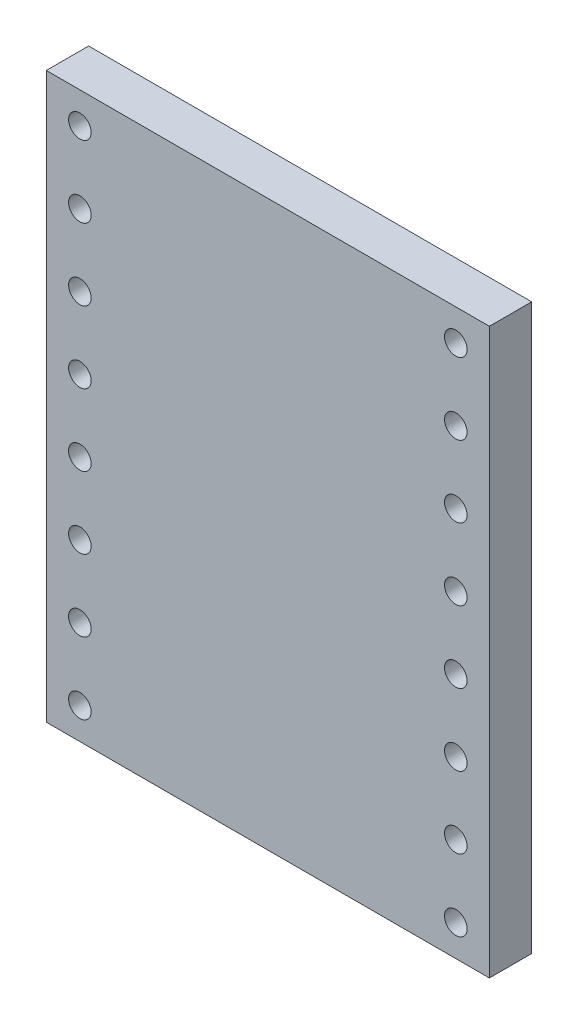
ISO-10303-21;
HEADER;
FILE_DESCRIPTION(('STEP AP214'),'2;1');
FILE_NAME('part.step','',(''),(''),'','','');
FILE_SCHEMA(('AUTOMOTIVE_DESIGN { 1 0 10303 214 1 1 1 1 }'));
ENDSEC;
DATA;
#1=APPLICATION_CONTEXT('core data for automotive mechanical design processes');
#2=APPLICATION_PROTOCOL_DEFINITION('international standard','automotive_design',2000,#1);
#3=PRODUCT_CONTEXT('',#1,'mechanical');
#4=PRODUCT('Part','Part','',(#3));
#5=PRODUCT_RELATED_PRODUCT_CATEGORY('part','',(#4));
#6=PRODUCT_DEFINITION_FORMATION('','',#4);
#7=PRODUCT_DEFINITION_CONTEXT('part definition',#1,'design');
#8=PRODUCT_DEFINITION('design','',#6,#7);
#9=PRODUCT_DEFINITION_SHAPE('','',#8);
#10=(LENGTH_UNIT() NAMED_UNIT(*) SI_UNIT(.MILLI.,.METRE.));
#11=(NAMED_UNIT(*) PLANE_ANGLE_UNIT() SI_UNIT($,.RADIAN.));
#12=(NAMED_UNIT(*) SI_UNIT($,.STERADIAN.) SOLID_ANGLE_UNIT());
#13=UNCERTAINTY_MEASURE_WITH_UNIT(LENGTH_MEASURE(1.E-05),#10,'distance_accuracy_value','');
#14=(GEOMETRIC_REPRESENTATION_CONTEXT(3) GLOBAL_UNCERTAINTY_ASSIGNED_CONTEXT((#13)) GLOBAL_UNIT_ASSIGNED_CONTEXT((#10,
#11,#12)) REPRESENTATION_CONTEXT('',''));
#15=CARTESIAN_POINT('',(0.,0.,0.));
#16=DIRECTION('',(0.,0.,1.));
#17=DIRECTION('',(1.,0.,0.));
#18=AXIS2_PLACEMENT_3D('',#15,#16,#17);
#19=CARTESIAN_POINT('',(7.85,-10.,1.5));
#20=DIRECTION('',(-1.,0.,0.));
#21=DIRECTION('',(0.,0.,1.));
#22=AXIS2_PLACEMENT_3D('',#19,#20,#21);
#23=PLANE('',#22);
#24=DIRECTION('',(0.,1.,0.));
#25=VECTOR('',#24,1.);
#26=CARTESIAN_POINT('',(7.85,-10.,0.));
#27=LINE('',#26,#25);
#28=CARTESIAN_POINT('',(7.85,-10.,0.));
#29=VERTEX_POINT('',#28);
#30=CARTESIAN_POINT('',(7.85,10.,0.));
#31=VERTEX_POINT('',#30);
#32=EDGE_CURVE('E95',#29,#31,#27,.T.);
#33=ORIENTED_EDGE('',*,*,#32,.T.);
#34=DIRECTION('',(0.,0.,-1.));
#35=VECTOR('',#34,1.);
#36=CARTESIAN_POINT('',(7.85,10.,1.5));
#37=LINE('',#36,#35);
#38=CARTESIAN_POINT('',(7.85,10.,1.5));
#39=VERTEX_POINT('',#38);
#40=EDGE_CURVE('E11',#39,#31,#37,.T.);
#41=ORIENTED_EDGE('',*,*,#40,.F.);
#42=DIRECTION('',(0.,1.,0.));
#43=VECTOR('',#42,1.);
#44=CARTESIAN_POINT('',(7.85,-10.,1.5));
#45=LINE('',#44,#43);
#46=CARTESIAN_POINT('',(7.85,-10.,1.5));
#47=VERTEX_POINT('',#46);
#48=EDGE_CURVE('E83',#47,#39,#45,.T.);
#49=ORIENTED_EDGE('',*,*,#48,.F.);
#50=DIRECTION('',(0.,0.,-1.));
#51=VECTOR('',#50,1.);
#52=CARTESIAN_POINT('',(7.85,-10.,1.5));
#53=LINE('',#52,#51);
#54=EDGE_CURVE('E91',#47,#29,#53,.T.);
#55=ORIENTED_EDGE('',*,*,#54,.T.);
#56=EDGE_LOOP('',(#33,#41,#49,#55));
#57=FACE_BOUND('',#56,.T.);
#58=ADVANCED_FACE('F32',(#57),#23,.F.);
#59=CARTESIAN_POINT('',(-7.85,10.,1.5));
#60=DIRECTION('',(0.,-1.,0.));
#61=DIRECTION('',(0.,0.,-1.));
#62=AXIS2_PLACEMENT_3D('',#59,#60,#61);
#63=PLANE('',#62);
#64=DIRECTION('',(-1.,0.,0.));
#65=VECTOR('',#64,1.);
#66=CARTESIAN_POINT('',(-7.85,10.,0.));
#67=LINE('',#66,#65);
#68=CARTESIAN_POINT('',(-7.85,10.,0.));
#69=VERTEX_POINT('',#68);
#70=EDGE_CURVE('E87',#31,#69,#67,.T.);
#71=ORIENTED_EDGE('',*,*,#70,.T.);
#72=DIRECTION('',(0.,0.,-1.));
#73=VECTOR('',#72,1.);
#74=CARTESIAN_POINT('',(-7.85,10.,1.5));
#75=LINE('',#74,#73);
#76=CARTESIAN_POINT('',(-7.85,10.,1.5));
#77=VERTEX_POINT('',#76);
#78=EDGE_CURVE('E40',#77,#69,#75,.T.);
#79=ORIENTED_EDGE('',*,*,#78,.F.);
#80=DIRECTION('',(-1.,0.,0.));
#81=VECTOR('',#80,1.);
#82=CARTESIAN_POINT('',(-7.85,10.,1.5));
#83=LINE('',#82,#81);
#84=EDGE_CURVE('E78',#39,#77,#83,.T.);
#85=ORIENTED_EDGE('',*,*,#84,.F.);
#86=ORIENTED_EDGE('',*,*,#40,.T.);
#87=EDGE_LOOP('',(#71,#79,#85,#86));
#88=FACE_BOUND('',#87,.T.);
#89=ADVANCED_FACE('F86',(#88),#63,.F.);
#90=CARTESIAN_POINT('',(-7.85,-10.,1.5));
#91=DIRECTION('',(1.,0.,0.));
#92=DIRECTION('',(0.,0.,-1.));
#93=AXIS2_PLACEMENT_3D('',#90,#91,#92);
#94=PLANE('',#93);
#95=DIRECTION('',(0.,-1.,0.));
#96=VECTOR('',#95,1.);
#97=CARTESIAN_POINT('',(-7.85,-10.,0.));
#98=LINE('',#97,#96);
#99=CARTESIAN_POINT('',(-7.85,-10.,0.));
#100=VERTEX_POINT('',#99);
#101=EDGE_CURVE('E65',#69,#100,#98,.T.);
#102=ORIENTED_EDGE('',*,*,#101,.T.);
#103=DIRECTION('',(0.,0.,-1.));
#104=VECTOR('',#103,1.);
#105=CARTESIAN_POINT('',(-7.85,-10.,1.5));
#106=LINE('',#105,#104);
#107=CARTESIAN_POINT('',(-7.85,-10.,1.5));
#108=VERTEX_POINT('',#107);
#109=EDGE_CURVE('E88',#108,#100,#106,.T.);
#110=ORIENTED_EDGE('',*,*,#109,.F.);
#111=DIRECTION('',(0.,-1.,0.));
#112=VECTOR('',#111,1.);
#113=CARTESIAN_POINT('',(-7.85,-10.,1.5));
#114=LINE('',#113,#112);
#115=EDGE_CURVE('E81',#77,#108,#114,.T.);
#116=ORIENTED_EDGE('',*,*,#115,.F.);
#117=ORIENTED_EDGE('',*,*,#78,.T.);
#118=EDGE_LOOP('',(#102,#110,#116,#117));
#119=FACE_BOUND('',#118,.T.);
#120=ADVANCED_FACE('F89',(#119),#94,.F.);
#121=CARTESIAN_POINT('',(-7.85,-10.,1.5));
#122=DIRECTION('',(0.,1.,0.));
#123=DIRECTION('',(0.,0.,1.));
#124=AXIS2_PLACEMENT_3D('',#121,#122,#123);
#125=PLANE('',#124);
#126=DIRECTION('',(1.,0.,0.));
#127=VECTOR('',#126,1.);
#128=CARTESIAN_POINT('',(-7.85,-10.,0.));
#129=LINE('',#128,#127);
#130=EDGE_CURVE('E71',#100,#29,#129,.T.);
#131=ORIENTED_EDGE('',*,*,#130,.T.);
#132=ORIENTED_EDGE('',*,*,#54,.F.);
#133=DIRECTION('',(1.,0.,0.));
#134=VECTOR('',#133,1.);
#135=CARTESIAN_POINT('',(-7.85,-10.,1.5));
#136=LINE('',#135,#134);
#137=EDGE_CURVE('E48',#108,#47,#136,.T.);
#138=ORIENTED_EDGE('',*,*,#137,.F.);
#139=ORIENTED_EDGE('',*,*,#109,.T.);
#140=EDGE_LOOP('',(#131,#132,#138,#139));
#141=FACE_BOUND('',#140,.T.);
#142=ADVANCED_FACE('F103',(#141),#125,.F.);
#143=CARTESIAN_POINT('',(0.,0.,1.5));
#144=DIRECTION('',(0.,0.,-1.));
#145=DIRECTION('',(-1.,0.,0.));
#146=AXIS2_PLACEMENT_3D('',#143,#144,#145);
#147=PLANE('',#146);
#148=CARTESIAN_POINT('',(6.66,8.89,1.5));
#149=DIRECTION('',(0.,0.,1.));
#150=DIRECTION('',(-1.,0.,0.));
#151=AXIS2_PLACEMENT_3D('',#148,#149,#150);
#152=CIRCLE('',#151,0.4);
#153=CARTESIAN_POINT('',(6.26,8.89,1.5));
#154=VERTEX_POINT('',#153);
#155=EDGE_CURVE('E199',#154,#154,#152,.T.);
#156=ORIENTED_EDGE('',*,*,#155,.F.);
#157=EDGE_LOOP('',(#156));
#158=FACE_BOUND('',#157,.T.);
#159=CARTESIAN_POINT('',(6.66,6.35,1.5));
#160=DIRECTION('',(0.,0.,1.));
#161=DIRECTION('',(-1.,0.,0.));
#162=AXIS2_PLACEMENT_3D('',#159,#160,#161);
#163=CIRCLE('',#162,0.4);
#164=CARTESIAN_POINT('',(6.26,6.35,1.5));
#165=VERTEX_POINT('',#164);
#166=EDGE_CURVE('E193',#165,#165,#163,.T.);
#167=ORIENTED_EDGE('',*,*,#166,.F.);
#168=EDGE_LOOP('',(#167));
#169=FACE_BOUND('',#168,.T.);
#170=CARTESIAN_POINT('',(6.66,3.81,1.5));
#171=DIRECTION('',(0.,0.,1.));
#172=DIRECTION('',(-1.,0.,0.));
#173=AXIS2_PLACEMENT_3D('',#170,#171,#172);
#174=CIRCLE('',#173,0.4);
#175=CARTESIAN_POINT('',(6.26,3.81,1.5));
#176=VERTEX_POINT('',#175);
#177=EDGE_CURVE('E187',#176,#176,#174,.T.);
#178=ORIENTED_EDGE('',*,*,#177,.F.);
#179=EDGE_LOOP('',(#178));
#180=FACE_BOUND('',#179,.T.);
#181=CARTESIAN_POINT('',(6.66,1.27,1.5));
#182=DIRECTION('',(0.,0.,1.));
#183=DIRECTION('',(-1.,0.,0.));
#184=AXIS2_PLACEMENT_3D('',#181,#182,#183);
#185=CIRCLE('',#184,0.4);
#186=CARTESIAN_POINT('',(6.26,1.27,1.5));
#187=VERTEX_POINT('',#186);
#188=EDGE_CURVE('E181',#187,#187,#185,.T.);
#189=ORIENTED_EDGE('',*,*,#188,.F.);
#190=EDGE_LOOP('',(#189));
#191=FACE_BOUND('',#190,.T.);
#192=CARTESIAN_POINT('',(6.66,-1.27,1.5));
#193=DIRECTION('',(0.,0.,1.));
#194=DIRECTION('',(-1.,0.,0.));
#195=AXIS2_PLACEMENT_3D('',#192,#193,#194);
#196=CIRCLE('',#195,0.4);
#197=CARTESIAN_POINT('',(6.26,-1.27,1.5));
#198=VERTEX_POINT('',#197);
#199=EDGE_CURVE('E175',#198,#198,#196,.T.);
#200=ORIENTED_EDGE('',*,*,#199,.F.);
#201=EDGE_LOOP('',(#200));
#202=FACE_BOUND('',#201,.T.);
#203=CARTESIAN_POINT('',(6.66,-3.81,1.5));
#204=DIRECTION('',(0.,0.,1.));
#205=DIRECTION('',(-1.,0.,0.));
#206=AXIS2_PLACEMENT_3D('',#203,#204,#205);
#207=CIRCLE('',#206,0.4);
#208=CARTESIAN_POINT('',(6.26,-3.81,1.5));
#209=VERTEX_POINT('',#208);
#210=EDGE_CURVE('E169',#209,#209,#207,.T.);
#211=ORIENTED_EDGE('',*,*,#210,.F.);
#212=EDGE_LOOP('',(#211));
#213=FACE_BOUND('',#212,.T.);
#214=CARTESIAN_POINT('',(6.66,-6.35,1.5));
#215=DIRECTION('',(0.,0.,1.));
#216=DIRECTION('',(-1.,0.,0.));
#217=AXIS2_PLACEMENT_3D('',#214,#215,#216);
#218=CIRCLE('',#217,0.4);
#219=CARTESIAN_POINT('',(6.26,-6.35,1.5));
#220=VERTEX_POINT('',#219);
#221=EDGE_CURVE('E163',#220,#220,#218,.T.);
#222=ORIENTED_EDGE('',*,*,#221,.F.);
#223=EDGE_LOOP('',(#222));
#224=FACE_BOUND('',#223,.T.);
#225=CARTESIAN_POINT('',(6.66,-8.89,1.5));
#226=DIRECTION('',(0.,0.,1.));
#227=DIRECTION('',(-1.,0.,0.));
#228=AXIS2_PLACEMENT_3D('',#225,#226,#227);
#229=CIRCLE('',#228,0.4);
#230=CARTESIAN_POINT('',(6.26,-8.89,1.5));
#231=VERTEX_POINT('',#230);
#232=EDGE_CURVE('E157',#231,#231,#229,.T.);
#233=ORIENTED_EDGE('',*,*,#232,.F.);
#234=EDGE_LOOP('',(#233));
#235=FACE_BOUND('',#234,.T.);
#236=CARTESIAN_POINT('',(-6.66,-8.89,1.5));
#237=DIRECTION('',(0.,0.,1.));
#238=DIRECTION('',(1.,0.,0.));
#239=AXIS2_PLACEMENT_3D('',#236,#237,#238);
#240=CIRCLE('',#239,0.4);
#241=CARTESIAN_POINT('',(-6.26,-8.89,1.5));
#242=VERTEX_POINT('',#241);
#243=EDGE_CURVE('E151',#242,#242,#240,.T.);
#244=ORIENTED_EDGE('',*,*,#243,.F.);
#245=EDGE_LOOP('',(#244));
#246=FACE_BOUND('',#245,.T.);
#247=CARTESIAN_POINT('',(-6.66,-6.35,1.5));
#248=DIRECTION('',(0.,0.,1.));
#249=DIRECTION('',(1.,0.,0.));
#250=AXIS2_PLACEMENT_3D('',#247,#248,#249);
#251=CIRCLE('',#250,0.4);
#252=CARTESIAN_POINT('',(-6.26,-6.35,1.5));
#253=VERTEX_POINT('',#252);
#254=EDGE_CURVE('E145',#253,#253,#251,.T.);
#255=ORIENTED_EDGE('',*,*,#254,.F.);
#256=EDGE_LOOP('',(#255));
#257=FACE_BOUND('',#256,.T.);
#258=CARTESIAN_POINT('',(-6.66,-3.81,1.5));
#259=DIRECTION('',(0.,0.,1.));
#260=DIRECTION('',(1.,0.,0.));
#261=AXIS2_PLACEMENT_3D('',#258,#259,#260);
#262=CIRCLE('',#261,0.4);
#263=CARTESIAN_POINT('',(-6.26,-3.81,1.5));
#264=VERTEX_POINT('',#263);
#265=EDGE_CURVE('E139',#264,#264,#262,.T.);
#266=ORIENTED_EDGE('',*,*,#265,.F.);
#267=EDGE_LOOP('',(#266));
#268=FACE_BOUND('',#267,.T.);
#269=CARTESIAN_POINT('',(-6.66,-1.27,1.5));
#270=DIRECTION('',(0.,0.,1.));
#271=DIRECTION('',(1.,0.,0.));
#272=AXIS2_PLACEMENT_3D('',#269,#270,#271);
#273=CIRCLE('',#272,0.4);
#274=CARTESIAN_POINT('',(-6.26,-1.27,1.5));
#275=VERTEX_POINT('',#274);
#276=EDGE_CURVE('E133',#275,#275,#273,.T.);
#277=ORIENTED_EDGE('',*,*,#276,.F.);
#278=EDGE_LOOP('',(#277));
#279=FACE_BOUND('',#278,.T.);
#280=CARTESIAN_POINT('',(-6.66,1.27,1.5));
#281=DIRECTION('',(0.,0.,1.));
#282=DIRECTION('',(1.,0.,0.));
#283=AXIS2_PLACEMENT_3D('',#280,#281,#282);
#284=CIRCLE('',#283,0.4);
#285=CARTESIAN_POINT('',(-6.26,1.27,1.5));
#286=VERTEX_POINT('',#285);
#287=EDGE_CURVE('E127',#286,#286,#284,.T.);
#288=ORIENTED_EDGE('',*,*,#287,.F.);
#289=EDGE_LOOP('',(#288));
#290=FACE_BOUND('',#289,.T.);
#291=CARTESIAN_POINT('',(-6.66,3.81,1.5));
#292=DIRECTION('',(0.,0.,1.));
#293=DIRECTION('',(1.,0.,0.));
#294=AXIS2_PLACEMENT_3D('',#291,#292,#293);
#295=CIRCLE('',#294,0.4);
#296=CARTESIAN_POINT('',(-6.26,3.81,1.5));
#297=VERTEX_POINT('',#296);
#298=EDGE_CURVE('E121',#297,#297,#295,.T.);
#299=ORIENTED_EDGE('',*,*,#298,.F.);
#300=EDGE_LOOP('',(#299));
#301=FACE_BOUND('',#300,.T.);
#302=CARTESIAN_POINT('',(-6.66,6.35,1.5));
#303=DIRECTION('',(0.,0.,1.));
#304=DIRECTION('',(1.,0.,0.));
#305=AXIS2_PLACEMENT_3D('',#302,#303,#304);
#306=CIRCLE('',#305,0.4);
#307=CARTESIAN_POINT('',(-6.26,6.35,1.5));
#308=VERTEX_POINT('',#307);
#309=EDGE_CURVE('E115',#308,#308,#306,.T.);
#310=ORIENTED_EDGE('',*,*,#309,.F.);
#311=EDGE_LOOP('',(#310));
#312=FACE_BOUND('',#311,.T.);
#313=CARTESIAN_POINT('',(-6.66,8.89,1.5));
#314=DIRECTION('',(0.,0.,1.));
#315=DIRECTION('',(1.,0.,0.));
#316=AXIS2_PLACEMENT_3D('',#313,#314,#315);
#317=CIRCLE('',#316,0.4);
#318=CARTESIAN_POINT('',(-6.26,8.89,1.5));
#319=VERTEX_POINT('',#318);
#320=EDGE_CURVE('E109',#319,#319,#317,.T.);
#321=ORIENTED_EDGE('',*,*,#320,.F.);
#322=EDGE_LOOP('',(#321));
#323=FACE_BOUND('',#322,.T.);
#324=ORIENTED_EDGE('',*,*,#48,.T.);
#325=ORIENTED_EDGE('',*,*,#84,.T.);
#326=ORIENTED_EDGE('',*,*,#115,.T.);
#327=ORIENTED_EDGE('',*,*,#137,.T.);
#328=EDGE_LOOP('',(#324,#325,#326,#327));
#329=FACE_BOUND('',#328,.T.);
#330=ADVANCED_FACE('F79',(#158,#169,#180,#191,#202,#213,#224,#235,#246,#257,#268,#279,#290,#301,
#312,#323,#329),#147,.F.);
#331=CARTESIAN_POINT('',(0.,0.,0.));
#332=DIRECTION('',(0.,0.,-1.));
#333=DIRECTION('',(-1.,0.,0.));
#334=AXIS2_PLACEMENT_3D('',#331,#332,#333);
#335=PLANE('',#334);
#336=CARTESIAN_POINT('',(6.66,8.89,0.));
#337=DIRECTION('',(0.,0.,1.));
#338=DIRECTION('',(-1.,0.,0.));
#339=AXIS2_PLACEMENT_3D('',#336,#337,#338);
#340=CIRCLE('',#339,0.4);
#341=CARTESIAN_POINT('',(6.26,8.89,0.));
#342=VERTEX_POINT('',#341);
#343=EDGE_CURVE('E196',#342,#342,#340,.T.);
#344=ORIENTED_EDGE('',*,*,#343,.T.);
#345=EDGE_LOOP('',(#344));
#346=FACE_BOUND('',#345,.T.);
#347=CARTESIAN_POINT('',(6.66,6.35,0.));
#348=DIRECTION('',(0.,0.,1.));
#349=DIRECTION('',(-1.,0.,0.));
#350=AXIS2_PLACEMENT_3D('',#347,#348,#349);
#351=CIRCLE('',#350,0.4);
#352=CARTESIAN_POINT('',(6.26,6.35,0.));
#353=VERTEX_POINT('',#352);
#354=EDGE_CURVE('E190',#353,#353,#351,.T.);
#355=ORIENTED_EDGE('',*,*,#354,.T.);
#356=EDGE_LOOP('',(#355));
#357=FACE_BOUND('',#356,.T.);
#358=CARTESIAN_POINT('',(6.66,3.81,0.));
#359=DIRECTION('',(0.,0.,1.));
#360=DIRECTION('',(-1.,0.,0.));
#361=AXIS2_PLACEMENT_3D('',#358,#359,#360);
#362=CIRCLE('',#361,0.4);
#363=CARTESIAN_POINT('',(6.26,3.81,0.));
#364=VERTEX_POINT('',#363);
#365=EDGE_CURVE('E184',#364,#364,#362,.T.);
#366=ORIENTED_EDGE('',*,*,#365,.T.);
#367=EDGE_LOOP('',(#366));
#368=FACE_BOUND('',#367,.T.);
#369=CARTESIAN_POINT('',(6.66,1.27,0.));
#370=DIRECTION('',(0.,0.,1.));
#371=DIRECTION('',(-1.,0.,0.));
#372=AXIS2_PLACEMENT_3D('',#369,#370,#371);
#373=CIRCLE('',#372,0.4);
#374=CARTESIAN_POINT('',(6.26,1.27,0.));
#375=VERTEX_POINT('',#374);
#376=EDGE_CURVE('E178',#375,#375,#373,.T.);
#377=ORIENTED_EDGE('',*,*,#376,.T.);
#378=EDGE_LOOP('',(#377));
#379=FACE_BOUND('',#378,.T.);
#380=CARTESIAN_POINT('',(6.66,-1.27,0.));
#381=DIRECTION('',(0.,0.,1.));
#382=DIRECTION('',(-1.,0.,0.));
#383=AXIS2_PLACEMENT_3D('',#380,#381,#382);
#384=CIRCLE('',#383,0.4);
#385=CARTESIAN_POINT('',(6.26,-1.27,0.));
#386=VERTEX_POINT('',#385);
#387=EDGE_CURVE('E172',#386,#386,#384,.T.);
#388=ORIENTED_EDGE('',*,*,#387,.T.);
#389=EDGE_LOOP('',(#388));
#390=FACE_BOUND('',#389,.T.);
#391=CARTESIAN_POINT('',(6.66,-3.81,0.));
#392=DIRECTION('',(0.,0.,1.));
#393=DIRECTION('',(-1.,0.,0.));
#394=AXIS2_PLACEMENT_3D('',#391,#392,#393);
#395=CIRCLE('',#394,0.4);
#396=CARTESIAN_POINT('',(6.26,-3.81,0.));
#397=VERTEX_POINT('',#396);
#398=EDGE_CURVE('E166',#397,#397,#395,.T.);
#399=ORIENTED_EDGE('',*,*,#398,.T.);
#400=EDGE_LOOP('',(#399));
#401=FACE_BOUND('',#400,.T.);
#402=CARTESIAN_POINT('',(6.66,-6.35,0.));
#403=DIRECTION('',(0.,0.,1.));
#404=DIRECTION('',(-1.,0.,0.));
#405=AXIS2_PLACEMENT_3D('',#402,#403,#404);
#406=CIRCLE('',#405,0.4);
#407=CARTESIAN_POINT('',(6.26,-6.35,0.));
#408=VERTEX_POINT('',#407);
#409=EDGE_CURVE('E160',#408,#408,#406,.T.);
#410=ORIENTED_EDGE('',*,*,#409,.T.);
#411=EDGE_LOOP('',(#410));
#412=FACE_BOUND('',#411,.T.);
#413=CARTESIAN_POINT('',(6.66,-8.89,0.));
#414=DIRECTION('',(0.,0.,1.));
#415=DIRECTION('',(-1.,0.,0.));
#416=AXIS2_PLACEMENT_3D('',#413,#414,#415);
#417=CIRCLE('',#416,0.4);
#418=CARTESIAN_POINT('',(6.26,-8.89,0.));
#419=VERTEX_POINT('',#418);
#420=EDGE_CURVE('E154',#419,#419,#417,.T.);
#421=ORIENTED_EDGE('',*,*,#420,.T.);
#422=EDGE_LOOP('',(#421));
#423=FACE_BOUND('',#422,.T.);
#424=CARTESIAN_POINT('',(-6.66,-8.89,0.));
#425=DIRECTION('',(0.,0.,1.));
#426=DIRECTION('',(1.,0.,0.));
#427=AXIS2_PLACEMENT_3D('',#424,#425,#426);
#428=CIRCLE('',#427,0.4);
#429=CARTESIAN_POINT('',(-6.26,-8.89,0.));
#430=VERTEX_POINT('',#429);
#431=EDGE_CURVE('E148',#430,#430,#428,.T.);
#432=ORIENTED_EDGE('',*,*,#431,.T.);
#433=EDGE_LOOP('',(#432));
#434=FACE_BOUND('',#433,.T.);
#435=CARTESIAN_POINT('',(-6.66,-6.35,0.));
#436=DIRECTION('',(0.,0.,1.));
#437=DIRECTION('',(1.,0.,0.));
#438=AXIS2_PLACEMENT_3D('',#435,#436,#437);
#439=CIRCLE('',#438,0.4);
#440=CARTESIAN_POINT('',(-6.26,-6.35,0.));
#441=VERTEX_POINT('',#440);
#442=EDGE_CURVE('E142',#441,#441,#439,.T.);
#443=ORIENTED_EDGE('',*,*,#442,.T.);
#444=EDGE_LOOP('',(#443));
#445=FACE_BOUND('',#444,.T.);
#446=CARTESIAN_POINT('',(-6.66,-3.81,0.));
#447=DIRECTION('',(0.,0.,1.));
#448=DIRECTION('',(1.,0.,0.));
#449=AXIS2_PLACEMENT_3D('',#446,#447,#448);
#450=CIRCLE('',#449,0.4);
#451=CARTESIAN_POINT('',(-6.26,-3.81,0.));
#452=VERTEX_POINT('',#451);
#453=EDGE_CURVE('E136',#452,#452,#450,.T.);
#454=ORIENTED_EDGE('',*,*,#453,.T.);
#455=EDGE_LOOP('',(#454));
#456=FACE_BOUND('',#455,.T.);
#457=CARTESIAN_POINT('',(-6.66,-1.27,0.));
#458=DIRECTION('',(0.,0.,1.));
#459=DIRECTION('',(1.,0.,0.));
#460=AXIS2_PLACEMENT_3D('',#457,#458,#459);
#461=CIRCLE('',#460,0.4);
#462=CARTESIAN_POINT('',(-6.26,-1.27,0.));
#463=VERTEX_POINT('',#462);
#464=EDGE_CURVE('E130',#463,#463,#461,.T.);
#465=ORIENTED_EDGE('',*,*,#464,.T.);
#466=EDGE_LOOP('',(#465));
#467=FACE_BOUND('',#466,.T.);
#468=CARTESIAN_POINT('',(-6.66,1.27,0.));
#469=DIRECTION('',(0.,0.,1.));
#470=DIRECTION('',(1.,0.,0.));
#471=AXIS2_PLACEMENT_3D('',#468,#469,#470);
#472=CIRCLE('',#471,0.4);
#473=CARTESIAN_POINT('',(-6.26,1.27,0.));
#474=VERTEX_POINT('',#473);
#475=EDGE_CURVE('E124',#474,#474,#472,.T.);
#476=ORIENTED_EDGE('',*,*,#475,.T.);
#477=EDGE_LOOP('',(#476));
#478=FACE_BOUND('',#477,.T.);
#479=CARTESIAN_POINT('',(-6.66,3.81,0.));
#480=DIRECTION('',(0.,0.,1.));
#481=DIRECTION('',(1.,0.,0.));
#482=AXIS2_PLACEMENT_3D('',#479,#480,#481);
#483=CIRCLE('',#482,0.4);
#484=CARTESIAN_POINT('',(-6.26,3.81,0.));
#485=VERTEX_POINT('',#484);
#486=EDGE_CURVE('E118',#485,#485,#483,.T.);
#487=ORIENTED_EDGE('',*,*,#486,.T.);
#488=EDGE_LOOP('',(#487));
#489=FACE_BOUND('',#488,.T.);
#490=CARTESIAN_POINT('',(-6.66,6.35,0.));
#491=DIRECTION('',(0.,0.,1.));
#492=DIRECTION('',(1.,0.,0.));
#493=AXIS2_PLACEMENT_3D('',#490,#491,#492);
#494=CIRCLE('',#493,0.4);
#495=CARTESIAN_POINT('',(-6.26,6.35,0.));
#496=VERTEX_POINT('',#495);
#497=EDGE_CURVE('E112',#496,#496,#494,.T.);
#498=ORIENTED_EDGE('',*,*,#497,.T.);
#499=EDGE_LOOP('',(#498));
#500=FACE_BOUND('',#499,.T.);
#501=CARTESIAN_POINT('',(-6.66,8.89,0.));
#502=DIRECTION('',(0.,0.,1.));
#503=DIRECTION('',(1.,0.,0.));
#504=AXIS2_PLACEMENT_3D('',#501,#502,#503);
#505=CIRCLE('',#504,0.4);
#506=CARTESIAN_POINT('',(-6.26,8.89,0.));
#507=VERTEX_POINT('',#506);
#508=EDGE_CURVE('E98',#507,#507,#505,.T.);
#509=ORIENTED_EDGE('',*,*,#508,.T.);
#510=EDGE_LOOP('',(#509));
#511=FACE_BOUND('',#510,.T.);
#512=ORIENTED_EDGE('',*,*,#32,.F.);
#513=ORIENTED_EDGE('',*,*,#130,.F.);
#514=ORIENTED_EDGE('',*,*,#101,.F.);
#515=ORIENTED_EDGE('',*,*,#70,.F.);
#516=EDGE_LOOP('',(#512,#513,#514,#515));
#517=FACE_BOUND('',#516,.T.);
#518=ADVANCED_FACE('F106',(#346,#357,#368,#379,#390,#401,#412,#423,#434,#445,#456,#467,#478,
#489,#500,#511,#517),#335,.T.);
#519=CARTESIAN_POINT('',(-6.66,8.89,0.));
#520=DIRECTION('',(0.,0.,1.));
#521=DIRECTION('',(1.,0.,0.));
#522=AXIS2_PLACEMENT_3D('',#519,#520,#521);
#523=CYLINDRICAL_SURFACE('',#522,0.4);
#524=ORIENTED_EDGE('',*,*,#508,.F.);
#525=EDGE_LOOP('',(#524));
#526=FACE_BOUND('',#525,.T.);
#527=ORIENTED_EDGE('',*,*,#320,.T.);
#528=EDGE_LOOP('',(#527));
#529=FACE_BOUND('',#528,.T.);
#530=ADVANCED_FACE('F247',(#526,#529),#523,.F.);
#531=CARTESIAN_POINT('',(-6.66,6.35,0.));
#532=DIRECTION('',(0.,0.,1.));
#533=DIRECTION('',(1.,0.,0.));
#534=AXIS2_PLACEMENT_3D('',#531,#532,#533);
#535=CYLINDRICAL_SURFACE('',#534,0.4);
#536=ORIENTED_EDGE('',*,*,#497,.F.);
#537=EDGE_LOOP('',(#536));
#538=FACE_BOUND('',#537,.T.);
#539=ORIENTED_EDGE('',*,*,#309,.T.);
#540=EDGE_LOOP('',(#539));
#541=FACE_BOUND('',#540,.T.);
#542=ADVANCED_FACE('F249',(#538,#541),#535,.F.);
#543=CARTESIAN_POINT('',(-6.66,3.81,0.));
#544=DIRECTION('',(0.,0.,1.));
#545=DIRECTION('',(1.,0.,0.));
#546=AXIS2_PLACEMENT_3D('',#543,#544,#545);
#547=CYLINDRICAL_SURFACE('',#546,0.4);
#548=ORIENTED_EDGE('',*,*,#486,.F.);
#549=EDGE_LOOP('',(#548));
#550=FACE_BOUND('',#549,.T.);
#551=ORIENTED_EDGE('',*,*,#298,.T.);
#552=EDGE_LOOP('',(#551));
#553=FACE_BOUND('',#552,.T.);
#554=ADVANCED_FACE('F256',(#550,#553),#547,.F.);
#555=CARTESIAN_POINT('',(-6.66,1.27,0.));
#556=DIRECTION('',(0.,0.,1.));
#557=DIRECTION('',(1.,0.,0.));
#558=AXIS2_PLACEMENT_3D('',#555,#556,#557);
#559=CYLINDRICAL_SURFACE('',#558,0.4);
#560=ORIENTED_EDGE('',*,*,#475,.F.);
#561=EDGE_LOOP('',(#560));
#562=FACE_BOUND('',#561,.T.);
#563=ORIENTED_EDGE('',*,*,#287,.T.);
#564=EDGE_LOOP('',(#563));
#565=FACE_BOUND('',#564,.T.);
#566=ADVANCED_FACE('F302',(#562,#565),#559,.F.);
#567=CARTESIAN_POINT('',(-6.66,-1.27,0.));
#568=DIRECTION('',(0.,0.,1.));
#569=DIRECTION('',(1.,0.,0.));
#570=AXIS2_PLACEMENT_3D('',#567,#568,#569);
#571=CYLINDRICAL_SURFACE('',#570,0.4);
#572=ORIENTED_EDGE('',*,*,#464,.F.);
#573=EDGE_LOOP('',(#572));
#574=FACE_BOUND('',#573,.T.);
#575=ORIENTED_EDGE('',*,*,#276,.T.);
#576=EDGE_LOOP('',(#575));
#577=FACE_BOUND('',#576,.T.);
#578=ADVANCED_FACE('F312',(#574,#577),#571,.F.);
#579=CARTESIAN_POINT('',(-6.66,-3.81,0.));
#580=DIRECTION('',(0.,0.,1.));
#581=DIRECTION('',(1.,0.,0.));
#582=AXIS2_PLACEMENT_3D('',#579,#580,#581);
#583=CYLINDRICAL_SURFACE('',#582,0.4);
#584=ORIENTED_EDGE('',*,*,#453,.F.);
#585=EDGE_LOOP('',(#584));
#586=FACE_BOUND('',#585,.T.);
#587=ORIENTED_EDGE('',*,*,#265,.T.);
#588=EDGE_LOOP('',(#587));
#589=FACE_BOUND('',#588,.T.);
#590=ADVANCED_FACE('F322',(#586,#589),#583,.F.);
#591=CARTESIAN_POINT('',(-6.66,-6.35,0.));
#592=DIRECTION('',(0.,0.,1.));
#593=DIRECTION('',(1.,0.,0.));
#594=AXIS2_PLACEMENT_3D('',#591,#592,#593);
#595=CYLINDRICAL_SURFACE('',#594,0.4);
#596=ORIENTED_EDGE('',*,*,#442,.F.);
#597=EDGE_LOOP('',(#596));
#598=FACE_BOUND('',#597,.T.);
#599=ORIENTED_EDGE('',*,*,#254,.T.);
#600=EDGE_LOOP('',(#599));
#601=FACE_BOUND('',#600,.T.);
#602=ADVANCED_FACE('F332',(#598,#601),#595,.F.);
#603=CARTESIAN_POINT('',(-6.66,-8.89,0.));
#604=DIRECTION('',(0.,0.,1.));
#605=DIRECTION('',(1.,0.,0.));
#606=AXIS2_PLACEMENT_3D('',#603,#604,#605);
#607=CYLINDRICAL_SURFACE('',#606,0.4);
#608=ORIENTED_EDGE('',*,*,#431,.F.);
#609=EDGE_LOOP('',(#608));
#610=FACE_BOUND('',#609,.T.);
#611=ORIENTED_EDGE('',*,*,#243,.T.);
#612=EDGE_LOOP('',(#611));
#613=FACE_BOUND('',#612,.T.);
#614=ADVANCED_FACE('F342',(#610,#613),#607,.F.);
#615=CARTESIAN_POINT('',(6.66,-8.89,0.));
#616=DIRECTION('',(0.,0.,1.));
#617=DIRECTION('',(1.,0.,0.));
#618=AXIS2_PLACEMENT_3D('',#615,#616,#617);
#619=CYLINDRICAL_SURFACE('',#618,0.4);
#620=ORIENTED_EDGE('',*,*,#420,.F.);
#621=EDGE_LOOP('',(#620));
#622=FACE_BOUND('',#621,.T.);
#623=ORIENTED_EDGE('',*,*,#232,.T.);
#624=EDGE_LOOP('',(#623));
#625=FACE_BOUND('',#624,.T.);
#626=ADVANCED_FACE('F352',(#622,#625),#619,.F.);
#627=CARTESIAN_POINT('',(6.66,-6.35,0.));
#628=DIRECTION('',(0.,0.,1.));
#629=DIRECTION('',(1.,0.,0.));
#630=AXIS2_PLACEMENT_3D('',#627,#628,#629);
#631=CYLINDRICAL_SURFACE('',#630,0.4);
#632=ORIENTED_EDGE('',*,*,#409,.F.);
#633=EDGE_LOOP('',(#632));
#634=FACE_BOUND('',#633,.T.);
#635=ORIENTED_EDGE('',*,*,#221,.T.);
#636=EDGE_LOOP('',(#635));
#637=FACE_BOUND('',#636,.T.);
#638=ADVANCED_FACE('F362',(#634,#637),#631,.F.);
#639=CARTESIAN_POINT('',(6.66,-3.81,0.));
#640=DIRECTION('',(0.,0.,1.));
#641=DIRECTION('',(1.,0.,0.));
#642=AXIS2_PLACEMENT_3D('',#639,#640,#641);
#643=CYLINDRICAL_SURFACE('',#642,0.4);
#644=ORIENTED_EDGE('',*,*,#398,.F.);
#645=EDGE_LOOP('',(#644));
#646=FACE_BOUND('',#645,.T.);
#647=ORIENTED_EDGE('',*,*,#210,.T.);
#648=EDGE_LOOP('',(#647));
#649=FACE_BOUND('',#648,.T.);
#650=ADVANCED_FACE('F372',(#646,#649),#643,.F.);
#651=CARTESIAN_POINT('',(6.66,-1.27,0.));
#652=DIRECTION('',(0.,0.,1.));
#653=DIRECTION('',(1.,0.,0.));
#654=AXIS2_PLACEMENT_3D('',#651,#652,#653);
#655=CYLINDRICAL_SURFACE('',#654,0.4);
#656=ORIENTED_EDGE('',*,*,#387,.F.);
#657=EDGE_LOOP('',(#656));
#658=FACE_BOUND('',#657,.T.);
#659=ORIENTED_EDGE('',*,*,#199,.T.);
#660=EDGE_LOOP('',(#659));
#661=FACE_BOUND('',#660,.T.);
#662=ADVANCED_FACE('F382',(#658,#661),#655,.F.);
#663=CARTESIAN_POINT('',(6.66,1.27,0.));
#664=DIRECTION('',(0.,0.,1.));
#665=DIRECTION('',(1.,0.,0.));
#666=AXIS2_PLACEMENT_3D('',#663,#664,#665);
#667=CYLINDRICAL_SURFACE('',#666,0.4);
#668=ORIENTED_EDGE('',*,*,#376,.F.);
#669=EDGE_LOOP('',(#668));
#670=FACE_BOUND('',#669,.T.);
#671=ORIENTED_EDGE('',*,*,#188,.T.);
#672=EDGE_LOOP('',(#671));
#673=FACE_BOUND('',#672,.T.);
#674=ADVANCED_FACE('F392',(#670,#673),#667,.F.);
#675=CARTESIAN_POINT('',(6.66,3.81,0.));
#676=DIRECTION('',(0.,0.,1.));
#677=DIRECTION('',(1.,0.,0.));
#678=AXIS2_PLACEMENT_3D('',#675,#676,#677);
#679=CYLINDRICAL_SURFACE('',#678,0.4);
#680=ORIENTED_EDGE('',*,*,#365,.F.);
#681=EDGE_LOOP('',(#680));
#682=FACE_BOUND('',#681,.T.);
#683=ORIENTED_EDGE('',*,*,#177,.T.);
#684=EDGE_LOOP('',(#683));
#685=FACE_BOUND('',#684,.T.);
#686=ADVANCED_FACE('F402',(#682,#685),#679,.F.);
#687=CARTESIAN_POINT('',(6.66,6.35,0.));
#688=DIRECTION('',(0.,0.,1.));
#689=DIRECTION('',(1.,0.,0.));
#690=AXIS2_PLACEMENT_3D('',#687,#688,#689);
#691=CYLINDRICAL_SURFACE('',#690,0.4);
#692=ORIENTED_EDGE('',*,*,#354,.F.);
#693=EDGE_LOOP('',(#692));
#694=FACE_BOUND('',#693,.T.);
#695=ORIENTED_EDGE('',*,*,#166,.T.);
#696=EDGE_LOOP('',(#695));
#697=FACE_BOUND('',#696,.T.);
#698=ADVANCED_FACE('F210',(#694,#697),#691,.F.);
#699=CARTESIAN_POINT('',(6.66,8.89,0.));
#700=DIRECTION('',(0.,0.,1.));
#701=DIRECTION('',(1.,0.,0.));
#702=AXIS2_PLACEMENT_3D('',#699,#700,#701);
#703=CYLINDRICAL_SURFACE('',#702,0.4);
#704=ORIENTED_EDGE('',*,*,#343,.F.);
#705=EDGE_LOOP('',(#704));
#706=FACE_BOUND('',#705,.T.);
#707=ORIENTED_EDGE('',*,*,#155,.T.);
#708=EDGE_LOOP('',(#707));
#709=FACE_BOUND('',#708,.T.);
#710=ADVANCED_FACE('F207',(#706,#709),#703,.F.);
#711=CLOSED_SHELL('',(#58,#89,#120,#142,#330,#518,#530,#542,#554,#566,#578,#590,#602,#614,#626,
#638,#650,#662,#674,#686,#698,#710));
#712=MANIFOLD_SOLID_BREP('B2',#711);
#713=ADVANCED_BREP_SHAPE_REPRESENTATION('',(#18,#712),#14);
#714=SHAPE_DEFINITION_REPRESENTATION(#9,#713);
ENDSEC;
END-ISO-10303-21;
